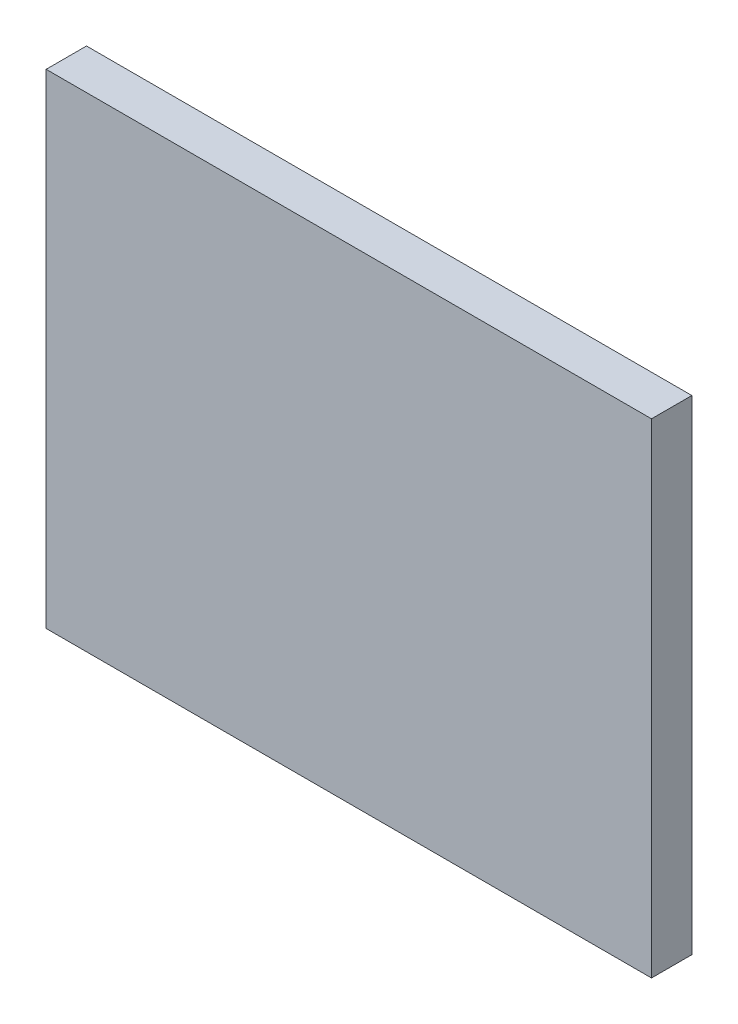
ISO-10303-21;
HEADER;
FILE_DESCRIPTION(('STEP AP214'),'2;1');
FILE_NAME('part.step','',(''),(''),'','','');
FILE_SCHEMA(('AUTOMOTIVE_DESIGN { 1 0 10303 214 1 1 1 1 }'));
ENDSEC;
DATA;
#1=APPLICATION_CONTEXT('core data for automotive mechanical design processes');
#2=APPLICATION_PROTOCOL_DEFINITION('international standard','automotive_design',2000,#1);
#3=PRODUCT_CONTEXT('',#1,'mechanical');
#4=PRODUCT('Part','Part','',(#3));
#5=PRODUCT_RELATED_PRODUCT_CATEGORY('part','',(#4));
#6=PRODUCT_DEFINITION_FORMATION('','',#4);
#7=PRODUCT_DEFINITION_CONTEXT('part definition',#1,'design');
#8=PRODUCT_DEFINITION('design','',#6,#7);
#9=PRODUCT_DEFINITION_SHAPE('','',#8);
#10=(LENGTH_UNIT() NAMED_UNIT(*) SI_UNIT(.MILLI.,.METRE.));
#11=(NAMED_UNIT(*) PLANE_ANGLE_UNIT() SI_UNIT($,.RADIAN.));
#12=(NAMED_UNIT(*) SI_UNIT($,.STERADIAN.) SOLID_ANGLE_UNIT());
#13=UNCERTAINTY_MEASURE_WITH_UNIT(LENGTH_MEASURE(1.E-05),#10,'distance_accuracy_value','');
#14=(GEOMETRIC_REPRESENTATION_CONTEXT(3) GLOBAL_UNCERTAINTY_ASSIGNED_CONTEXT((#13)) GLOBAL_UNIT_ASSIGNED_CONTEXT((#10,
#11,#12)) REPRESENTATION_CONTEXT('',''));
#15=CARTESIAN_POINT('',(0.,0.,0.));
#16=DIRECTION('',(0.,0.,1.));
#17=DIRECTION('',(1.,0.,0.));
#18=AXIS2_PLACEMENT_3D('',#15,#16,#17);
#19=CARTESIAN_POINT('',(20.2,7.622377902208,2.5));
#20=DIRECTION('',(0.,0.,1.));
#21=DIRECTION('',(1.,0.,0.));
#22=AXIS2_PLACEMENT_3D('',#19,#20,#21);
#23=PLANE('',#22);
#24=DIRECTION('',(0.,1.,0.));
#25=VECTOR('',#24,1.);
#26=CARTESIAN_POINT('',(20.2,-6.2,2.5));
#27=LINE('',#26,#25);
#28=CARTESIAN_POINT('',(20.2,-6.2,2.5));
#29=VERTEX_POINT('',#28);
#30=CARTESIAN_POINT('',(20.2,5.8,2.5));
#31=VERTEX_POINT('',#30);
#32=EDGE_CURVE('E55',#29,#31,#27,.T.);
#33=ORIENTED_EDGE('',*,*,#32,.F.);
#34=DIRECTION('',(1.,0.,0.));
#35=VECTOR('',#34,1.);
#36=CARTESIAN_POINT('',(5.2,-6.2,2.5));
#37=LINE('',#36,#35);
#38=CARTESIAN_POINT('',(5.2,-6.2,2.5));
#39=VERTEX_POINT('',#38);
#40=EDGE_CURVE('E20',#39,#29,#37,.T.);
#41=ORIENTED_EDGE('',*,*,#40,.F.);
#42=DIRECTION('',(0.,1.,0.));
#43=VECTOR('',#42,1.);
#44=CARTESIAN_POINT('',(5.2,5.8,2.5));
#45=LINE('',#44,#43);
#46=CARTESIAN_POINT('',(5.2,5.8,2.5));
#47=VERTEX_POINT('',#46);
#48=EDGE_CURVE('E81',#47,#39,#45,.F.);
#49=ORIENTED_EDGE('',*,*,#48,.F.);
#50=DIRECTION('',(1.,0.,0.));
#51=VECTOR('',#50,1.);
#52=CARTESIAN_POINT('',(20.2,5.8,2.5));
#53=LINE('',#52,#51);
#54=EDGE_CURVE('E68',#31,#47,#53,.F.);
#55=ORIENTED_EDGE('',*,*,#54,.F.);
#56=EDGE_LOOP('',(#33,#41,#49,#55));
#57=FACE_BOUND('',#56,.T.);
#58=ADVANCED_FACE('F17',(#57),#23,.F.);
#59=CARTESIAN_POINT('',(5.2,-6.2,1.5));
#60=DIRECTION('',(0.,-1.,0.));
#61=DIRECTION('',(0.,0.,-1.));
#62=AXIS2_PLACEMENT_3D('',#59,#60,#61);
#63=PLANE('',#62);
#64=DIRECTION('',(0.,0.,1.));
#65=VECTOR('',#64,1.);
#66=CARTESIAN_POINT('',(5.2,-6.2,1.5));
#67=LINE('',#66,#65);
#68=CARTESIAN_POINT('',(5.2,-6.2,3.5));
#69=VERTEX_POINT('',#68);
#70=EDGE_CURVE('E64',#39,#69,#67,.T.);
#71=ORIENTED_EDGE('',*,*,#70,.F.);
#72=ORIENTED_EDGE('',*,*,#40,.T.);
#73=DIRECTION('',(0.,0.,-1.));
#74=VECTOR('',#73,1.);
#75=CARTESIAN_POINT('',(20.2,-6.2,1.5));
#76=LINE('',#75,#74);
#77=CARTESIAN_POINT('',(20.2,-6.2,3.5));
#78=VERTEX_POINT('',#77);
#79=EDGE_CURVE('E61',#78,#29,#76,.T.);
#80=ORIENTED_EDGE('',*,*,#79,.F.);
#81=DIRECTION('',(1.,0.,0.));
#82=VECTOR('',#81,1.);
#83=CARTESIAN_POINT('',(0.,-6.2,3.5));
#84=LINE('',#83,#82);
#85=EDGE_CURVE('E83',#69,#78,#84,.T.);
#86=ORIENTED_EDGE('',*,*,#85,.F.);
#87=EDGE_LOOP('',(#71,#72,#80,#86));
#88=FACE_BOUND('',#87,.T.);
#89=ADVANCED_FACE('F60',(#88),#63,.T.);
#90=CARTESIAN_POINT('',(20.2,-6.2,1.5));
#91=DIRECTION('',(1.,0.,0.));
#92=DIRECTION('',(0.,0.,-1.));
#93=AXIS2_PLACEMENT_3D('',#90,#91,#92);
#94=PLANE('',#93);
#95=ORIENTED_EDGE('',*,*,#79,.T.);
#96=ORIENTED_EDGE('',*,*,#32,.T.);
#97=DIRECTION('',(0.,0.,1.));
#98=VECTOR('',#97,1.);
#99=CARTESIAN_POINT('',(20.2,5.8,1.5));
#100=LINE('',#99,#98);
#101=CARTESIAN_POINT('',(20.2,5.8,3.5));
#102=VERTEX_POINT('',#101);
#103=EDGE_CURVE('E70',#102,#31,#100,.F.);
#104=ORIENTED_EDGE('',*,*,#103,.F.);
#105=DIRECTION('',(0.,1.,0.));
#106=VECTOR('',#105,1.);
#107=CARTESIAN_POINT('',(20.2,0.,3.5));
#108=LINE('',#107,#106);
#109=EDGE_CURVE('E74',#78,#102,#108,.T.);
#110=ORIENTED_EDGE('',*,*,#109,.F.);
#111=EDGE_LOOP('',(#95,#96,#104,#110));
#112=FACE_BOUND('',#111,.T.);
#113=ADVANCED_FACE('F72',(#112),#94,.T.);
#114=CARTESIAN_POINT('',(20.2,5.8,1.5));
#115=DIRECTION('',(0.,1.,0.));
#116=DIRECTION('',(0.,0.,1.));
#117=AXIS2_PLACEMENT_3D('',#114,#115,#116);
#118=PLANE('',#117);
#119=ORIENTED_EDGE('',*,*,#103,.T.);
#120=ORIENTED_EDGE('',*,*,#54,.T.);
#121=DIRECTION('',(0.,0.,1.));
#122=VECTOR('',#121,1.);
#123=CARTESIAN_POINT('',(5.2,5.8,1.5));
#124=LINE('',#123,#122);
#125=CARTESIAN_POINT('',(5.2,5.8,3.5));
#126=VERTEX_POINT('',#125);
#127=EDGE_CURVE('E35',#126,#47,#124,.F.);
#128=ORIENTED_EDGE('',*,*,#127,.F.);
#129=DIRECTION('',(1.,0.,0.));
#130=VECTOR('',#129,1.);
#131=CARTESIAN_POINT('',(0.,5.8,3.5));
#132=LINE('',#131,#130);
#133=EDGE_CURVE('E26',#102,#126,#132,.F.);
#134=ORIENTED_EDGE('',*,*,#133,.F.);
#135=EDGE_LOOP('',(#119,#120,#128,#134));
#136=FACE_BOUND('',#135,.T.);
#137=ADVANCED_FACE('F89',(#136),#118,.T.);
#138=CARTESIAN_POINT('',(5.2,5.8,1.5));
#139=DIRECTION('',(-1.,0.,0.));
#140=DIRECTION('',(0.,0.,1.));
#141=AXIS2_PLACEMENT_3D('',#138,#139,#140);
#142=PLANE('',#141);
#143=ORIENTED_EDGE('',*,*,#127,.T.);
#144=ORIENTED_EDGE('',*,*,#48,.T.);
#145=ORIENTED_EDGE('',*,*,#70,.T.);
#146=DIRECTION('',(0.,1.,0.));
#147=VECTOR('',#146,1.);
#148=CARTESIAN_POINT('',(5.2,0.,3.5));
#149=LINE('',#148,#147);
#150=EDGE_CURVE('E11',#126,#69,#149,.F.);
#151=ORIENTED_EDGE('',*,*,#150,.F.);
#152=EDGE_LOOP('',(#143,#144,#145,#151));
#153=FACE_BOUND('',#152,.T.);
#154=ADVANCED_FACE('F91',(#153),#142,.T.);
#155=CARTESIAN_POINT('',(0.,0.,3.5));
#156=DIRECTION('',(0.,0.,1.));
#157=DIRECTION('',(1.,0.,0.));
#158=AXIS2_PLACEMENT_3D('',#155,#156,#157);
#159=PLANE('',#158);
#160=ORIENTED_EDGE('',*,*,#133,.T.);
#161=ORIENTED_EDGE('',*,*,#150,.T.);
#162=ORIENTED_EDGE('',*,*,#85,.T.);
#163=ORIENTED_EDGE('',*,*,#109,.T.);
#164=EDGE_LOOP('',(#160,#161,#162,#163));
#165=FACE_BOUND('',#164,.T.);
#166=ADVANCED_FACE('F88',(#165),#159,.T.);
#167=CLOSED_SHELL('',(#58,#89,#113,#137,#154,#166));
#168=MANIFOLD_SOLID_BREP('B1',#167);
#169=ADVANCED_BREP_SHAPE_REPRESENTATION('',(#18,#168),#14);
#170=SHAPE_DEFINITION_REPRESENTATION(#9,#169);
ENDSEC;
END-ISO-10303-21;
